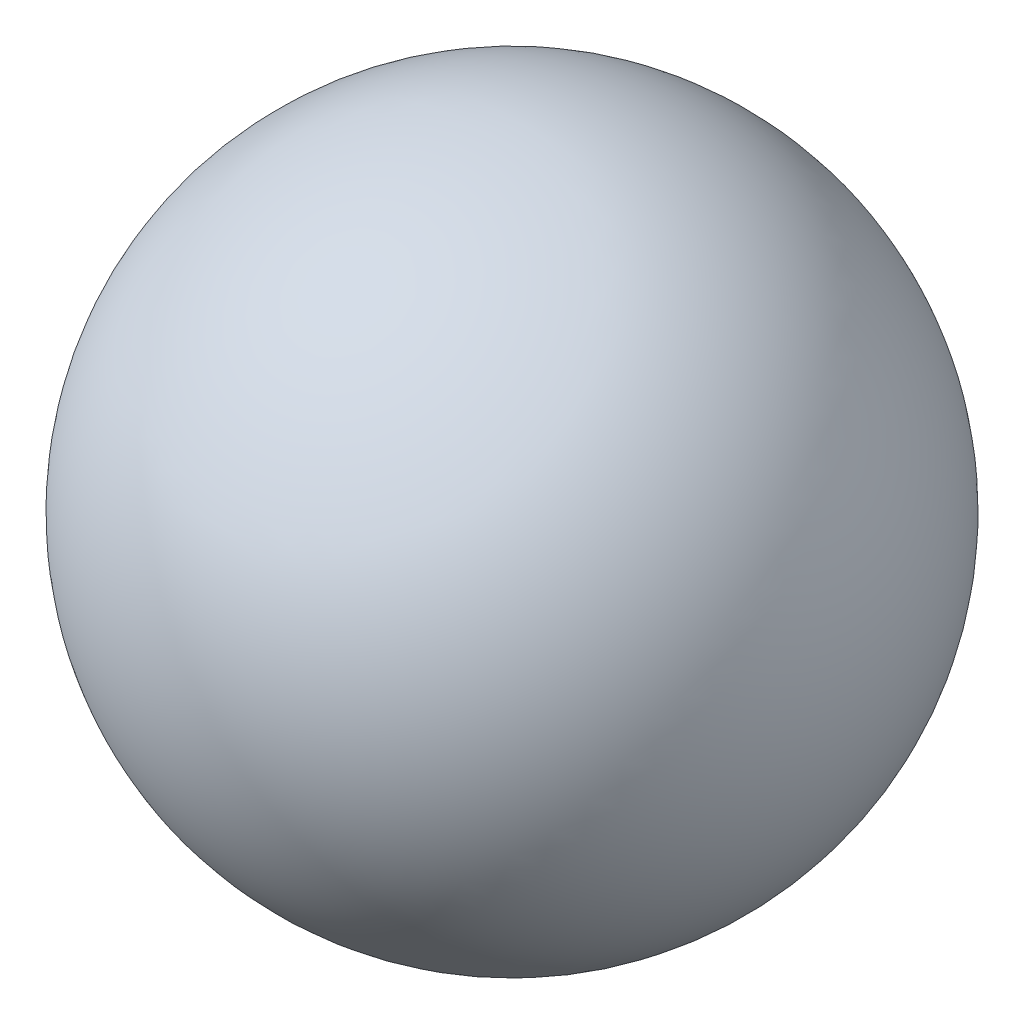
ISO-10303-21;
HEADER;
FILE_DESCRIPTION(('STEP AP214'),'2;1');
FILE_NAME('part.step','',(''),(''),'','','');
FILE_SCHEMA(('AUTOMOTIVE_DESIGN { 1 0 10303 214 1 1 1 1 }'));
ENDSEC;
DATA;
#1=APPLICATION_CONTEXT('core data for automotive mechanical design processes');
#2=APPLICATION_PROTOCOL_DEFINITION('international standard','automotive_design',2000,#1);
#3=PRODUCT_CONTEXT('',#1,'mechanical');
#4=PRODUCT('Part','Part','',(#3));
#5=PRODUCT_RELATED_PRODUCT_CATEGORY('part','',(#4));
#6=PRODUCT_DEFINITION_FORMATION('','',#4);
#7=PRODUCT_DEFINITION_CONTEXT('part definition',#1,'design');
#8=PRODUCT_DEFINITION('design','',#6,#7);
#9=PRODUCT_DEFINITION_SHAPE('','',#8);
#10=(LENGTH_UNIT() NAMED_UNIT(*) SI_UNIT(.MILLI.,.METRE.));
#11=(NAMED_UNIT(*) PLANE_ANGLE_UNIT() SI_UNIT($,.RADIAN.));
#12=(NAMED_UNIT(*) SI_UNIT($,.STERADIAN.) SOLID_ANGLE_UNIT());
#13=UNCERTAINTY_MEASURE_WITH_UNIT(LENGTH_MEASURE(1.E-05),#10,'distance_accuracy_value','');
#14=(GEOMETRIC_REPRESENTATION_CONTEXT(3) GLOBAL_UNCERTAINTY_ASSIGNED_CONTEXT((#13)) GLOBAL_UNIT_ASSIGNED_CONTEXT((#10,
#11,#12)) REPRESENTATION_CONTEXT('',''));
#15=CARTESIAN_POINT('',(0.,0.,0.));
#16=DIRECTION('',(0.,0.,1.));
#17=DIRECTION('',(1.,0.,0.));
#18=AXIS2_PLACEMENT_3D('',#15,#16,#17);
#19=CARTESIAN_POINT('',(10.1757984944672,-2.,-5.875));
#20=DIRECTION('',(0.,0.,1.));
#21=DIRECTION('',(1.,0.,0.));
#22=AXIS2_PLACEMENT_3D('',#19,#20,#21);
#23=SPHERICAL_SURFACE('',#22,1.05);
#24=CARTESIAN_POINT('',(10.1757984944672,-2.,-4.825));
#25=VERTEX_POINT('',#24);
#26=VERTEX_LOOP('',#25);
#27=FACE_BOUND('',#26,.T.);
#28=ADVANCED_FACE('F13',(#27),#23,.T.);
#29=CLOSED_SHELL('',(#28));
#30=MANIFOLD_SOLID_BREP('B1',#29);
#31=ADVANCED_BREP_SHAPE_REPRESENTATION('',(#18,#30),#14);
#32=SHAPE_DEFINITION_REPRESENTATION(#9,#31);
ENDSEC;
END-ISO-10303-21;
